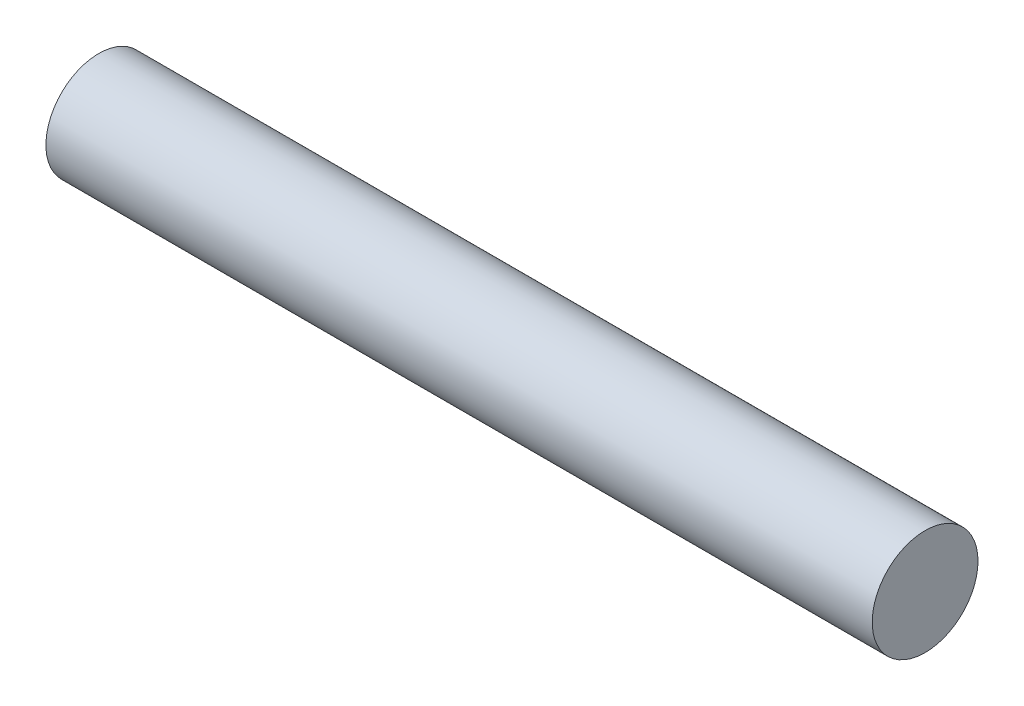
ISO-10303-21;
HEADER;
FILE_DESCRIPTION(('STEP AP214'),'2;1');
FILE_NAME('part.step','',(''),(''),'','','');
FILE_SCHEMA(('AUTOMOTIVE_DESIGN { 1 0 10303 214 1 1 1 1 }'));
ENDSEC;
DATA;
#1=APPLICATION_CONTEXT('core data for automotive mechanical design processes');
#2=APPLICATION_PROTOCOL_DEFINITION('international standard','automotive_design',2000,#1);
#3=PRODUCT_CONTEXT('',#1,'mechanical');
#4=PRODUCT('Part','Part','',(#3));
#5=PRODUCT_RELATED_PRODUCT_CATEGORY('part','',(#4));
#6=PRODUCT_DEFINITION_FORMATION('','',#4);
#7=PRODUCT_DEFINITION_CONTEXT('part definition',#1,'design');
#8=PRODUCT_DEFINITION('design','',#6,#7);
#9=PRODUCT_DEFINITION_SHAPE('','',#8);
#10=(LENGTH_UNIT() NAMED_UNIT(*) SI_UNIT(.MILLI.,.METRE.));
#11=(NAMED_UNIT(*) PLANE_ANGLE_UNIT() SI_UNIT($,.RADIAN.));
#12=(NAMED_UNIT(*) SI_UNIT($,.STERADIAN.) SOLID_ANGLE_UNIT());
#13=UNCERTAINTY_MEASURE_WITH_UNIT(LENGTH_MEASURE(1.E-05),#10,'distance_accuracy_value','');
#14=(GEOMETRIC_REPRESENTATION_CONTEXT(3) GLOBAL_UNCERTAINTY_ASSIGNED_CONTEXT((#13)) GLOBAL_UNIT_ASSIGNED_CONTEXT((#10,
#11,#12)) REPRESENTATION_CONTEXT('',''));
#15=CARTESIAN_POINT('',(0.,0.,0.));
#16=DIRECTION('',(0.,0.,1.));
#17=DIRECTION('',(1.,0.,0.));
#18=AXIS2_PLACEMENT_3D('',#15,#16,#17);
#19=CARTESIAN_POINT('',(127.,0.,0.));
#20=DIRECTION('',(-1.,0.,0.));
#21=DIRECTION('',(0.,0.,1.));
#22=AXIS2_PLACEMENT_3D('',#19,#20,#21);
#23=CYLINDRICAL_SURFACE('',#22,8.128);
#24=CARTESIAN_POINT('',(127.,0.,0.));
#25=DIRECTION('',(1.,0.,0.));
#26=DIRECTION('',(0.,0.,-1.));
#27=AXIS2_PLACEMENT_3D('',#24,#25,#26);
#28=CIRCLE('',#27,8.128);
#29=CARTESIAN_POINT('',(127.,0.,-8.128));
#30=VERTEX_POINT('',#29);
#31=EDGE_CURVE('E10',#30,#30,#28,.T.);
#32=ORIENTED_EDGE('',*,*,#31,.F.);
#33=EDGE_LOOP('',(#32));
#34=FACE_BOUND('',#33,.T.);
#35=CARTESIAN_POINT('',(0.,0.,0.));
#36=DIRECTION('',(1.,0.,0.));
#37=DIRECTION('',(0.,0.,-1.));
#38=AXIS2_PLACEMENT_3D('',#35,#36,#37);
#39=CIRCLE('',#38,8.128);
#40=CARTESIAN_POINT('',(0.,0.,-8.128));
#41=VERTEX_POINT('',#40);
#42=EDGE_CURVE('E36',#41,#41,#39,.T.);
#43=ORIENTED_EDGE('',*,*,#42,.T.);
#44=EDGE_LOOP('',(#43));
#45=FACE_BOUND('',#44,.T.);
#46=ADVANCED_FACE('F33',(#34,#45),#23,.T.);
#47=CARTESIAN_POINT('',(127.,0.,0.));
#48=DIRECTION('',(1.,0.,0.));
#49=DIRECTION('',(0.,0.,-1.));
#50=AXIS2_PLACEMENT_3D('',#47,#48,#49);
#51=PLANE('',#50);
#52=ORIENTED_EDGE('',*,*,#31,.T.);
#53=EDGE_LOOP('',(#52));
#54=FACE_BOUND('',#53,.T.);
#55=ADVANCED_FACE('F48',(#54),#51,.T.);
#56=CARTESIAN_POINT('',(0.,0.,0.));
#57=DIRECTION('',(1.,0.,0.));
#58=DIRECTION('',(0.,0.,-1.));
#59=AXIS2_PLACEMENT_3D('',#56,#57,#58);
#60=PLANE('',#59);
#61=ORIENTED_EDGE('',*,*,#42,.F.);
#62=EDGE_LOOP('',(#61));
#63=FACE_BOUND('',#62,.T.);
#64=ADVANCED_FACE('F46',(#63),#60,.F.);
#65=CLOSED_SHELL('',(#46,#55,#64));
#66=MANIFOLD_SOLID_BREP('B2',#65);
#67=ADVANCED_BREP_SHAPE_REPRESENTATION('',(#18,#66),#14);
#68=SHAPE_DEFINITION_REPRESENTATION(#9,#67);
ENDSEC;
END-ISO-10303-21;
